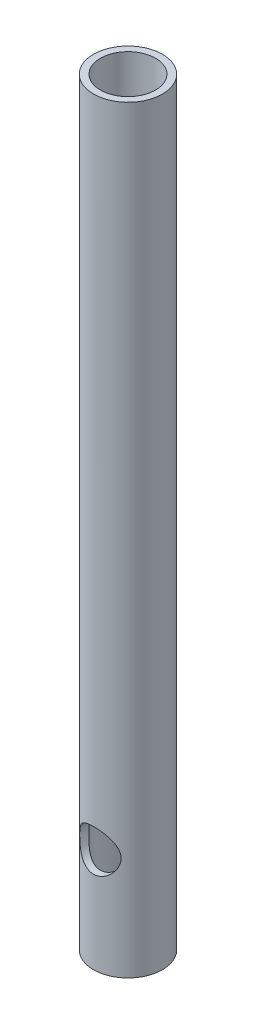
ISO-10303-21;
HEADER;
FILE_DESCRIPTION(('STEP AP214'),'2;1');
FILE_NAME('part.step','',(''),(''),'','','');
FILE_SCHEMA(('AUTOMOTIVE_DESIGN { 1 0 10303 214 1 1 1 1 }'));
ENDSEC;
DATA;
#1=APPLICATION_CONTEXT('core data for automotive mechanical design processes');
#2=APPLICATION_PROTOCOL_DEFINITION('international standard','automotive_design',2000,#1);
#3=PRODUCT_CONTEXT('',#1,'mechanical');
#4=PRODUCT('Part','Part','',(#3));
#5=PRODUCT_RELATED_PRODUCT_CATEGORY('part','',(#4));
#6=PRODUCT_DEFINITION_FORMATION('','',#4);
#7=PRODUCT_DEFINITION_CONTEXT('part definition',#1,'design');
#8=PRODUCT_DEFINITION('design','',#6,#7);
#9=PRODUCT_DEFINITION_SHAPE('','',#8);
#10=(LENGTH_UNIT() NAMED_UNIT(*) SI_UNIT(.MILLI.,.METRE.));
#11=(NAMED_UNIT(*) PLANE_ANGLE_UNIT() SI_UNIT($,.RADIAN.));
#12=(NAMED_UNIT(*) SI_UNIT($,.STERADIAN.) SOLID_ANGLE_UNIT());
#13=UNCERTAINTY_MEASURE_WITH_UNIT(LENGTH_MEASURE(1.E-05),#10,'distance_accuracy_value','');
#14=(GEOMETRIC_REPRESENTATION_CONTEXT(3) GLOBAL_UNCERTAINTY_ASSIGNED_CONTEXT((#13)) GLOBAL_UNIT_ASSIGNED_CONTEXT((#10,
#11,#12)) REPRESENTATION_CONTEXT('',''));
#15=CARTESIAN_POINT('',(0.,0.,0.));
#16=DIRECTION('',(0.,0.,1.));
#17=DIRECTION('',(1.,0.,0.));
#18=AXIS2_PLACEMENT_3D('',#15,#16,#17);
#19=CARTESIAN_POINT('',(87.7298711603,96.4507965263342,127.807872395026));
#20=DIRECTION('',(0.,1.,0.));
#21=DIRECTION('',(0.,0.,1.));
#22=AXIS2_PLACEMENT_3D('',#19,#20,#21);
#23=CYLINDRICAL_SURFACE('',#22,4.99999999999988);
#24=CARTESIAN_POINT('',(87.7298711603,108.450796526334,132.807872395026));
#25=CARTESIAN_POINT('',(87.8066408897352,108.450797582579,132.80787147049));
#26=CARTESIAN_POINT('',(87.8834332948184,108.453750119904,132.806098073149));
#27=CARTESIAN_POINT('',(88.0364196480587,108.465510759314,132.799056020732));
#28=CARTESIAN_POINT('',(88.1126132196466,108.474322287522,132.793785320565));
#29=CARTESIAN_POINT('',(88.3396792903247,108.509445085797,132.772865848551));
#30=CARTESIAN_POINT('',(88.4888530235917,108.544444228768,132.752110120739));
#31=CARTESIAN_POINT('',(88.7774128339359,108.635569269838,132.699104784985));
#32=CARTESIAN_POINT('',(88.9168434277134,108.691590448347,132.666912190537));
#33=CARTESIAN_POINT('',(89.1839215883022,108.822517186931,132.593779417584));
#34=CARTESIAN_POINT('',(89.3115720696826,108.897418058694,132.552841411173));
#35=CARTESIAN_POINT('',(89.5624727641182,109.070346181449,132.46197970786));
#36=CARTESIAN_POINT('',(89.6846400201617,109.169703917501,132.411608265445));
#37=CARTESIAN_POINT('',(89.9116357477806,109.385730933526,132.308481154085));
#38=CARTESIAN_POINT('',(90.016441627804,109.502422400553,132.255722490601));
#39=CARTESIAN_POINT('',(90.2187713553984,109.766643547503,132.146093743359));
#40=CARTESIAN_POINT('',(90.3138265565784,109.916200068456,132.089512751384));
#41=CARTESIAN_POINT('',(90.4770998470079,110.232489672661,131.986638420987));
#42=CARTESIAN_POINT('',(90.5453614918581,110.399194318367,131.940328439775));
#43=CARTESIAN_POINT('',(90.6386832060723,110.703989427991,131.874964988798));
#44=CARTESIAN_POINT('',(90.6701951061764,110.839268524696,131.852030058412));
#45=CARTESIAN_POINT('',(90.7141946061708,111.114403956856,131.819678560302));
#46=CARTESIAN_POINT('',(90.7267058591436,111.254254379638,131.81024518592));
#47=CARTESIAN_POINT('',(90.7319813284982,111.534819518982,131.806290846288));
#48=CARTESIAN_POINT('',(90.7247067966078,111.675535392246,131.811799142593));
#49=CARTESIAN_POINT('',(90.6907924017611,111.953354061452,131.836937616582));
#50=CARTESIAN_POINT('',(90.6641379725544,112.090454059276,131.856578416374));
#51=CARTESIAN_POINT('',(90.5933494796319,112.355857068585,131.906936160855));
#52=CARTESIAN_POINT('',(90.5494456945289,112.484250849329,131.937506728026));
#53=CARTESIAN_POINT('',(90.4457728349707,112.732186292966,132.006413322056));
#54=CARTESIAN_POINT('',(90.3859979444416,112.851724690163,132.044752194441));
#55=CARTESIAN_POINT('',(90.2402288985067,113.100765663991,132.132979378682));
#56=CARTESIAN_POINT('',(90.1514778793187,113.228356518702,132.183715030833));
#57=CARTESIAN_POINT('',(89.9557007923778,113.468145683554,132.286482620267));
#58=CARTESIAN_POINT('',(89.848657253655,113.580329091736,132.338515755802));
#59=CARTESIAN_POINT('',(89.6014615695136,113.802038785783,132.446590064655));
#60=CARTESIAN_POINT('',(89.4587743120877,113.909015917572,132.502179214557));
#61=CARTESIAN_POINT('',(89.2304816966028,114.050065239057,132.578055654976));
#62=CARTESIAN_POINT('',(89.1519693784568,114.09386066185,132.602105547401));
#63=CARTESIAN_POINT('',(88.9906148470391,114.174515349945,132.64703736259));
#64=CARTESIAN_POINT('',(88.9077753353118,114.211378878355,132.667921230916));
#65=CARTESIAN_POINT('',(88.74363487204,114.275607969191,132.704699122475));
#66=CARTESIAN_POINT('',(88.662561226964,114.303423086783,132.720823399575));
#67=CARTESIAN_POINT('',(88.4977511100328,114.35213048218,132.749263662973));
#68=CARTESIAN_POINT('',(88.4140161574747,114.373026634781,132.761581780559));
#69=CARTESIAN_POINT('',(88.2446156229544,114.407568381059,132.782036100175));
#70=CARTESIAN_POINT('',(88.1589515022696,114.421219282163,132.790175363235));
#71=CARTESIAN_POINT('',(87.9864929068922,114.441062710724,132.80203235917));
#72=CARTESIAN_POINT('',(87.8996985929178,114.447256287186,132.805750713923));
#73=CARTESIAN_POINT('',(87.6625469031894,114.453789196618,132.809663974574));
#74=CARTESIAN_POINT('',(87.5118143176894,114.446608071965,132.805337520744));
#75=CARTESIAN_POINT('',(87.214184252671,114.409950984605,132.783451945227));
#76=CARTESIAN_POINT('',(87.067286695447,114.380475473992,132.76589309187));
#77=CARTESIAN_POINT('',(86.7847285610452,114.30170806715,132.719766871583));
#78=CARTESIAN_POINT('',(86.6488816117306,114.252915399742,132.691477539323));
#79=CARTESIAN_POINT('',(86.3873377084525,114.137442202133,132.626150381309));
#80=CARTESIAN_POINT('',(86.2616427628373,114.07075814374,132.58911083018));
#81=CARTESIAN_POINT('',(86.0098592389985,113.913682435356,132.504782205619));
#82=CARTESIAN_POINT('',(85.8850830220578,113.821548832497,132.456828419095));
#83=CARTESIAN_POINT('',(85.6518189348178,113.620013775079,132.357357737285));
#84=CARTESIAN_POINT('',(85.5433503087584,113.510592226732,132.30583673546));
#85=CARTESIAN_POINT('',(85.3312312776584,113.260975734841,132.196780863383));
#86=CARTESIAN_POINT('',(85.2300507814583,113.118628752391,132.139337227327));
#87=CARTESIAN_POINT('',(85.0529663682246,112.816364480207,132.032196038982));
#88=CARTESIAN_POINT('',(84.9770358218454,112.656465939183,131.98249035564));
#89=CARTESIAN_POINT('',(84.8670195867829,112.358310481224,131.907570579319));
#90=CARTESIAN_POINT('',(84.8274386536739,112.222835901692,131.879385581365));
#91=CARTESIAN_POINT('',(84.767597882083,111.945732370099,131.836064510132));
#92=CARTESIAN_POINT('',(84.7473112563493,111.804112236883,131.820910348305));
#93=CARTESIAN_POINT('',(84.7271885499579,111.518042631939,131.805881326925));
#94=CARTESIAN_POINT('',(84.7274293699915,111.373584548086,131.806063922474));
#95=CARTESIAN_POINT('',(84.7485417092689,111.087007651988,131.821826754354));
#96=CARTESIAN_POINT('',(84.7694244466041,110.944890154459,131.837415363263));
#97=CARTESIAN_POINT('',(84.8290676481777,110.673819702339,131.880536094688));
#98=CARTESIAN_POINT('',(84.8669183170135,110.54456237841,131.907456612182));
#99=CARTESIAN_POINT('',(84.9586064251797,110.294121976681,131.969982453192));
#100=CARTESIAN_POINT('',(85.0124498851228,110.172941960721,132.005591046501));
#101=CARTESIAN_POINT('',(85.144085791703,109.922156986874,132.08813212453));
#102=CARTESIAN_POINT('',(85.2242859779844,109.79411501812,132.135963820823));
#103=CARTESIAN_POINT('',(85.4023590228304,109.552035681028,132.234275261766));
#104=CARTESIAN_POINT('',(85.5002464341793,109.438009975855,132.284757162517));
#105=CARTESIAN_POINT('',(85.7296676247744,109.208097683005,132.392384777729));
#106=CARTESIAN_POINT('',(85.8640854423948,109.094946646473,132.449272852412));
#107=CARTESIAN_POINT('',(86.1529783821656,108.892588540286,132.555186690405));
#108=CARTESIAN_POINT('',(86.3074606645632,108.803390053415,132.604209632921));
#109=CARTESIAN_POINT('',(86.5488492636831,108.691672052144,132.667077978175));
#110=CARTESIAN_POINT('',(86.6296210174486,108.65846053037,132.686043786879));
#111=CARTESIAN_POINT('',(86.7944289423116,108.599024388191,132.720306532778));
#112=CARTESIAN_POINT('',(86.8784631755119,108.572795690633,132.735605610391));
#113=CARTESIAN_POINT('',(87.0488693442254,108.527787084259,132.762027674906));
#114=CARTESIAN_POINT('',(87.1352336596907,108.508985449031,132.773162837345));
#115=CARTESIAN_POINT('',(87.3096874142792,108.479052171011,132.790955581478));
#116=CARTESIAN_POINT('',(87.3977753535156,108.467914140181,132.797616892264));
#117=CARTESIAN_POINT('',(87.5267472306386,108.457404842529,132.803909679241));
#118=CARTESIAN_POINT('',(87.5673148791865,108.45492809588,132.805394376818));
#119=CARTESIAN_POINT('',(87.6485432821132,108.45162362942,132.807375996719));
#120=CARTESIAN_POINT('',(87.6892040396728,108.450795966811,132.807872884779));
#121=CARTESIAN_POINT('',(87.7298711603,108.450796526334,132.807872395026));
#122=B_SPLINE_CURVE_WITH_KNOTS('',3,(#24,#25,#26,#27,#28,#29,#30,#31,#32,#33,#34,#35,#36,#37,
#38,#39,#40,#41,#42,#43,#44,#45,#46,#47,#48,#49,#50,#51,#52,#53,#54,#55,#56,#57,#58,#59,#60,#61,
#62,#63,#64,#65,#66,#67,#68,#69,#70,#71,#72,#73,#74,#75,#76,#77,#78,#79,#80,#81,#82,#83,#84,#85,
#86,#87,#88,#89,#90,#91,#92,#93,#94,#95,#96,#97,#98,#99,#100,#101,#102,#103,#104,#105,#106,#107,
#108,#109,#110,#111,#112,#113,#114,#115,#116,#117,#118,#119,#120,#121),.UNSPECIFIED.,.T.,.F.,(4,
2,2,2,2,2,2,2,2,2,2,2,2,2,2,2,2,2,2,2,2,2,2,2,2,2,2,2,2,2,2,2,2,2,2,2,2,2,2,2,2,2,2,2,2,2,2,2,
4),(0.,0.230263300595014,0.460661369333425,0.922002149276126,1.38107466343612,1.84003329022064,
2.33408870888555,2.82878205293211,3.38413315803227,3.93857770807796,4.35913349134877,
4.77916531256767,5.20002031165063,5.62119195971356,6.03692224610025,6.45280509043347,
6.94139679873936,7.43045779030961,7.98767605192996,8.26653157143434,8.54521503013736,
8.80648473589063,9.06760787545944,9.32853946730961,9.5894343502696,10.0398406663534,
10.490237849174,10.9296843257003,11.3692175250854,11.8543559282721,12.3400624135416,
12.8890638604651,13.437484464234,13.8674843581987,14.2968863865713,14.7278971274536,
15.1591422350194,15.5696105785277,15.9802336423656,16.4539008129506,16.927959499309,
17.4794148474153,18.0310675325446,18.2988384573895,18.5664526907295,18.8332781687618,
19.0998809626715,19.2218537856861,19.3438308395354),.UNSPECIFIED.);
#123=CARTESIAN_POINT('',(87.7298711603,108.450796526334,132.807872395026));
#124=VERTEX_POINT('',#123);
#125=EDGE_CURVE('E78',#124,#124,#122,.T.);
#126=ORIENTED_EDGE('',*,*,#125,.F.);
#127=EDGE_LOOP('',(#126));
#128=FACE_BOUND('',#127,.T.);
#129=CARTESIAN_POINT('',(84.7298711603,111.450796526334,123.807872395026));
#130=CARTESIAN_POINT('',(84.7298712543076,111.5262581367,123.80787242408));
#131=CARTESIAN_POINT('',(84.732724559555,111.60171647816,123.805726787242));
#132=CARTESIAN_POINT('',(84.7440751400617,111.75198010549,123.797253336614));
#133=CARTESIAN_POINT('',(84.7525745777817,111.826785130015,123.790923920445));
#134=CARTESIAN_POINT('',(84.78636920153,112.049338927134,123.766012509483));
#135=CARTESIAN_POINT('',(84.8199607923742,112.195262689373,123.741507161388));
#136=CARTESIAN_POINT('',(84.9070022796567,112.476991820207,123.680627731893));
#137=CARTESIAN_POINT('',(84.9603088244876,112.612861936056,123.644339552899));
#138=CARTESIAN_POINT('',(85.084812220907,112.87366369776,123.564153816715));
#139=CARTESIAN_POINT('',(85.1560144089164,112.998592065812,123.52025399097));
#140=CARTESIAN_POINT('',(85.3244477409894,113.25069783658,123.423300280629));
#141=CARTESIAN_POINT('',(85.4237969604605,113.37628260708,123.369783426703));
#142=CARTESIAN_POINT('',(85.641325738708,113.610321882703,123.263349357388));
#143=CARTESIAN_POINT('',(85.7595194093646,113.718763427757,123.210432623469));
#144=CARTESIAN_POINT('',(86.0270253798773,113.927078995049,123.104354413372));
#145=CARTESIAN_POINT('',(86.1783198672009,114.024762939975,123.051783698776));
#146=CARTESIAN_POINT('',(86.4185468559084,114.150543034922,122.982166758332));
#147=CARTESIAN_POINT('',(86.500863792474,114.189020641792,122.960495781416));
#148=CARTESIAN_POINT('',(86.6693989473037,114.258587491213,122.920862367466));
#149=CARTESIAN_POINT('',(86.7556145413532,114.289681618046,122.902897479835));
#150=CARTESIAN_POINT('',(86.9229031336286,114.341423988788,122.872760456161));
#151=CARTESIAN_POINT('',(87.0036870015598,114.362783797863,122.860200230555));
#152=CARTESIAN_POINT('',(87.1672048115556,114.398746487685,122.838949157149));
#153=CARTESIAN_POINT('',(87.2499376397724,114.413353133972,122.830256153101));
#154=CARTESIAN_POINT('',(87.4166265390326,114.43558121085,122.816994846273));
#155=CARTESIAN_POINT('',(87.5005819330346,114.443206368646,122.812424342634));
#156=CARTESIAN_POINT('',(87.6689313714148,114.451363166181,122.807532978952));
#157=CARTESIAN_POINT('',(87.7533253702897,114.451895527628,122.807211686542));
#158=CARTESIAN_POINT('',(87.9850423439463,114.443553744055,122.812219694153));
#159=CARTESIAN_POINT('',(88.1320911175671,114.427325376685,122.821967598885));
#160=CARTESIAN_POINT('',(88.4208274091184,114.373841032652,122.853708489523));
#161=CARTESIAN_POINT('',(88.5625145294313,114.336583499724,122.875702381693));
#162=CARTESIAN_POINT('',(88.8379772309919,114.242464293332,122.930175319906));
#163=CARTESIAN_POINT('',(88.9717021275266,114.185490106134,122.962714473618));
#164=CARTESIAN_POINT('',(89.2278504959035,114.054027591883,123.035679354568));
#165=CARTESIAN_POINT('',(89.3502710211124,113.979534716198,123.076107129577));
#166=CARTESIAN_POINT('',(89.5960190582924,113.805118246716,123.167113966634));
#167=CARTESIAN_POINT('',(89.7177083151075,113.703219877799,123.218328761788));
#168=CARTESIAN_POINT('',(89.9433006495317,113.481988316229,123.322761287058));
#169=CARTESIAN_POINT('',(90.0471792346411,113.362631526615,123.375981654485));
#170=CARTESIAN_POINT('',(90.2463678618932,113.093489705937,123.485650899773));
#171=CARTESIAN_POINT('',(90.3392898095759,112.941781371005,123.541759169189));
#172=CARTESIAN_POINT('',(90.4978155186545,112.621384065308,123.642854802019));
#173=CARTESIAN_POINT('',(90.5634696038137,112.45272709502,123.687862588809));
#174=CARTESIAN_POINT('',(90.6514210983843,112.146009261839,123.749955091273));
#175=CARTESIAN_POINT('',(90.6804292234848,112.010715260542,123.771194622241));
#176=CARTESIAN_POINT('',(90.7194886184705,111.736049306933,123.800029379894));
#177=CARTESIAN_POINT('',(90.7295619354055,111.59668228945,123.807640474579));
#178=CARTESIAN_POINT('',(90.7301667735238,111.317693157373,123.808094106742));
#179=CARTESIAN_POINT('',(90.7206712210619,111.178070956733,123.800916183532));
#180=CARTESIAN_POINT('',(90.6826770050163,110.902821854021,123.772841986273));
#181=CARTESIAN_POINT('',(90.6541633207511,110.767198198514,123.751934868993));
#182=CARTESIAN_POINT('',(90.5796372889793,110.503367310785,123.699237002166));
#183=CARTESIAN_POINT('',(90.5336468041149,110.375151042197,123.667459855444));
#184=CARTESIAN_POINT('',(90.425796842948,110.127841306027,123.596441704437));
#185=CARTESIAN_POINT('',(90.3639313806517,110.00875130174,123.557197886134));
#186=CARTESIAN_POINT('',(90.2132179183386,109.760315431088,123.467135580779));
#187=CARTESIAN_POINT('',(90.121516198827,109.632991094005,123.415505865211));
#188=CARTESIAN_POINT('',(89.9196273012589,109.394229322389,123.311439042497));
#189=CARTESIAN_POINT('',(89.8094224348713,109.28280728024,123.2590012068));
#190=CARTESIAN_POINT('',(89.5563859155832,109.064332535019,123.15115247964));
#191=CARTESIAN_POINT('',(89.4111751305003,108.959731820571,123.096241591595));
#192=CARTESIAN_POINT('',(89.1793174730851,108.822642028611,123.021877813005));
#193=CARTESIAN_POINT('',(89.0996572174165,108.780234524197,122.998415988258));
#194=CARTESIAN_POINT('',(88.9361077219233,108.702492642856,122.954818388161));
#195=CARTESIAN_POINT('',(88.8522211862858,108.667153813216,122.934680520386));
#196=CARTESIAN_POINT('',(88.687011859075,108.6063168831,122.899665722489));
#197=CARTESIAN_POINT('',(88.605940627638,108.580292807872,122.884514082239));
#198=CARTESIAN_POINT('',(88.4413317802813,108.535131544725,122.858047420435));
#199=CARTESIAN_POINT('',(88.3577955750089,108.515990497454,122.84673024908));
#200=CARTESIAN_POINT('',(88.1889907753823,108.484896216621,122.828273355714));
#201=CARTESIAN_POINT('',(88.1037234016041,108.472938088974,122.821130789423));
#202=CARTESIAN_POINT('',(87.9322553194635,108.456389764675,122.81123022527));
#203=CARTESIAN_POINT('',(87.8460547342454,108.451798607545,122.80847165584));
#204=CARTESIAN_POINT('',(87.6103517762194,108.449468236575,122.807078859007));
#205=CARTESIAN_POINT('',(87.4606580253284,108.45919545176,122.81293619745));
#206=CARTESIAN_POINT('',(87.1655456158225,108.500578580483,122.837608480578));
#207=CARTESIAN_POINT('',(87.0201270048445,108.532234738274,122.856423569591));
#208=CARTESIAN_POINT('',(86.7395875428697,108.615237096981,122.904885134796));
#209=CARTESIAN_POINT('',(86.6043391038132,108.666259965883,122.934353388667));
#210=CARTESIAN_POINT('',(86.3443052071185,108.786077468098,123.00180531519));
#211=CARTESIAN_POINT('',(86.2195221040971,108.854876086678,123.039790897147));
#212=CARTESIAN_POINT('',(85.9693446321799,109.01664643323,123.126003778236));
#213=CARTESIAN_POINT('',(85.8453545257591,109.111431589862,123.1748952491));
#214=CARTESIAN_POINT('',(85.6140753824031,109.3183049509,123.275834501438));
#215=CARTESIAN_POINT('',(85.5068051149854,109.430412323999,123.32788574028));
#216=CARTESIAN_POINT('',(85.2980541617736,109.685357569713,123.43730789771));
#217=CARTESIAN_POINT('',(85.1990327485019,109.830289610823,123.494516355124));
#218=CARTESIAN_POINT('',(85.0267250996888,110.137806098929,123.600347817351));
#219=CARTESIAN_POINT('',(84.9534254842233,110.300381310532,123.648975279249));
#220=CARTESIAN_POINT('',(84.8679363111542,110.547419079022,123.707825090389));
#221=CARTESIAN_POINT('',(84.8441587941667,110.626455117631,123.724577308244));
#222=CARTESIAN_POINT('',(84.8030773428445,110.786926968134,123.753921518467));
#223=CARTESIAN_POINT('',(84.7857693125764,110.868361226322,123.766516142479));
#224=CARTESIAN_POINT('',(84.7579589475857,111.032843077028,123.786922672764));
#225=CARTESIAN_POINT('',(84.7474458219848,111.115887894706,123.794742161256));
#226=CARTESIAN_POINT('',(84.7334023154456,111.282888742998,123.805216681248));
#227=CARTESIAN_POINT('',(84.7298710557155,111.366844657597,123.807872362704));
#228=CARTESIAN_POINT('',(84.7298711603,111.450796526334,123.807872395026));
#229=B_SPLINE_CURVE_WITH_KNOTS('',3,(#129,#130,#131,#132,#133,#134,#135,#136,#137,#138,#139,
#140,#141,#142,#143,#144,#145,#146,#147,#148,#149,#150,#151,#152,#153,#154,#155,#156,#157,#158,
#159,#160,#161,#162,#163,#164,#165,#166,#167,#168,#169,#170,#171,#172,#173,#174,#175,#176,#177,
#178,#179,#180,#181,#182,#183,#184,#185,#186,#187,#188,#189,#190,#191,#192,#193,#194,#195,#196,
#197,#198,#199,#200,#201,#202,#203,#204,#205,#206,#207,#208,#209,#210,#211,#212,#213,#214,#215,
#216,#217,#218,#219,#220,#221,#222,#223,#224,#225,#226,#227,#228),.UNSPECIFIED.,.T.,.F.,(4,2,2,
2,2,2,2,2,2,2,2,2,2,2,2,2,2,2,2,2,2,2,2,2,2,2,2,2,2,2,2,2,2,2,2,2,2,2,2,2,2,2,2,2,2,2,2,2,2,4),
(0.,0.226288173517889,0.452663065091124,0.905305714765857,1.35471981612576,1.80426809059901,
2.30878181396805,2.81367513819685,3.37309572088445,3.65297634398313,3.93267130287331,
4.18580566749447,4.43879871451848,4.69165661737854,4.9444887912271,5.38694235003539,
5.82942865693066,6.27448283989929,6.71965270654931,7.21799594026829,7.71701907227943,
8.27387316194679,8.82969494223664,9.24786570023496,9.66554925202083,10.0838110593649,
10.5024036052238,10.9204742264512,11.3387027222345,11.8323285087813,12.3264288987104,
12.8847762993731,13.1641700331408,13.4433872125907,13.7024631857777,13.9613936663243,
14.2201475237758,14.4788676430947,14.9267946196282,15.3747265854331,15.8154875864153,
16.2563474905319,16.7450674536299,17.2343321574793,17.7856420979723,18.3366648323363,
18.5890061072372,18.8411873492279,19.0929671157918,19.3447151893883),.UNSPECIFIED.);
#230=CARTESIAN_POINT('',(84.7298711603,111.450796526334,123.807872395026));
#231=VERTEX_POINT('',#230);
#232=EDGE_CURVE('E73',#231,#231,#229,.T.);
#233=ORIENTED_EDGE('',*,*,#232,.F.);
#234=EDGE_LOOP('',(#233));
#235=FACE_BOUND('',#234,.T.);
#236=CARTESIAN_POINT('',(87.7298711603,96.4507965263342,127.807872395026));
#237=DIRECTION('',(0.,1.,0.));
#238=DIRECTION('',(0.,0.,1.));
#239=AXIS2_PLACEMENT_3D('',#236,#237,#238);
#240=CIRCLE('',#239,4.99999999999988);
#241=CARTESIAN_POINT('',(87.7298711603,96.4507965263342,132.807872395026));
#242=VERTEX_POINT('',#241);
#243=EDGE_CURVE('E10',#242,#242,#240,.T.);
#244=ORIENTED_EDGE('',*,*,#243,.T.);
#245=EDGE_LOOP('',(#244));
#246=FACE_BOUND('',#245,.T.);
#247=CARTESIAN_POINT('',(87.7298711603,206.450796526334,127.807872395026));
#248=DIRECTION('',(0.,1.,0.));
#249=DIRECTION('',(0.,0.,1.));
#250=AXIS2_PLACEMENT_3D('',#247,#248,#249);
#251=CIRCLE('',#250,4.99999999999988);
#252=CARTESIAN_POINT('',(87.7298711603,206.450796526334,132.807872395026));
#253=VERTEX_POINT('',#252);
#254=EDGE_CURVE('E51',#253,#253,#251,.T.);
#255=ORIENTED_EDGE('',*,*,#254,.F.);
#256=EDGE_LOOP('',(#255));
#257=FACE_BOUND('',#256,.T.);
#258=ADVANCED_FACE('F33',(#128,#235,#246,#257),#23,.T.);
#259=CARTESIAN_POINT('',(87.7298711603,96.4507965263342,127.807872395026));
#260=DIRECTION('',(0.,1.,0.));
#261=DIRECTION('',(0.,0.,1.));
#262=AXIS2_PLACEMENT_3D('',#259,#260,#261);
#263=PLANE('',#262);
#264=CARTESIAN_POINT('',(87.7298711603,96.4507965263342,127.807872395026));
#265=DIRECTION('',(0.,1.,0.));
#266=DIRECTION('',(0.,0.,1.));
#267=AXIS2_PLACEMENT_3D('',#264,#265,#266);
#268=CIRCLE('',#267,4.00000000000001);
#269=CARTESIAN_POINT('',(87.7298711603,96.4507965263342,131.807872395026));
#270=VERTEX_POINT('',#269);
#271=EDGE_CURVE('E46',#270,#270,#268,.T.);
#272=ORIENTED_EDGE('',*,*,#271,.T.);
#273=EDGE_LOOP('',(#272));
#274=FACE_BOUND('',#273,.T.);
#275=ORIENTED_EDGE('',*,*,#243,.F.);
#276=EDGE_LOOP('',(#275));
#277=FACE_BOUND('',#276,.T.);
#278=ADVANCED_FACE('F92',(#274,#277),#263,.F.);
#279=CARTESIAN_POINT('',(87.7298711603,96.4507965263342,127.807872395026));
#280=DIRECTION('',(0.,1.,0.));
#281=DIRECTION('',(0.,0.,1.));
#282=AXIS2_PLACEMENT_3D('',#279,#280,#281);
#283=CYLINDRICAL_SURFACE('',#282,4.00000000000001);
#284=CARTESIAN_POINT('',(87.7298711603,108.450796526334,131.807872395026));
#285=CARTESIAN_POINT('',(87.803132528068,108.450797268353,131.807871694038));
#286=CARTESIAN_POINT('',(87.8764135113536,108.453487033321,131.805852998472));
#287=CARTESIAN_POINT('',(88.0223796992935,108.464191386469,131.79783485202));
#288=CARTESIAN_POINT('',(88.0950645210932,108.472209160839,131.79183301919));
#289=CARTESIAN_POINT('',(88.3116025672839,108.504132432362,131.767999845897));
#290=CARTESIAN_POINT('',(88.4537638206924,108.535907484325,131.74434127516));
#291=CARTESIAN_POINT('',(88.7283777993113,108.61822173391,131.683787299105));
#292=CARTESIAN_POINT('',(88.8608837949565,108.668646874717,131.646972398167));
#293=CARTESIAN_POINT('',(89.1147064302409,108.785881893266,131.562882565241));
#294=CARTESIAN_POINT('',(89.2360263288842,108.852686977918,131.515610693561));
#295=CARTESIAN_POINT('',(89.4768032922516,109.007320251555,131.408865965161));
#296=CARTESIAN_POINT('',(89.5950474706052,109.096522377608,131.348668628169));
#297=CARTESIAN_POINT('',(89.8159356597078,109.289797022177,131.223202674838));
#298=CARTESIAN_POINT('',(89.9185550712146,109.393892498782,131.157926301378));
#299=CARTESIAN_POINT('',(90.069803440562,109.571331870439,131.052794767643));
#300=CARTESIAN_POINT('',(90.1236657433415,109.640426638744,131.013161553132));
#301=CARTESIAN_POINT('',(90.2253547457826,109.783385657159,130.934641274364));
#302=CARTESIAN_POINT('',(90.2731796254355,109.857251335385,130.895754438087));
#303=CARTESIAN_POINT('',(90.3624829464933,110.009568321215,130.819978020556));
#304=CARTESIAN_POINT('',(90.4039690072184,110.088013964297,130.783086076458));
#305=CARTESIAN_POINT('',(90.4803024870714,110.249503573883,130.71266579234));
#306=CARTESIAN_POINT('',(90.515150981075,110.332546793048,130.679136908129));
#307=CARTESIAN_POINT('',(90.5874720668895,110.529758801758,130.607417722834));
#308=CARTESIAN_POINT('',(90.6223815303841,110.645566300269,130.571028014264));
#309=CARTESIAN_POINT('',(90.6782877234614,110.883593589468,130.511303683908));
#310=CARTESIAN_POINT('',(90.699316304475,111.005798000671,130.487939193425));
#311=CARTESIAN_POINT('',(90.726126758543,111.255158550806,130.457947749969));
#312=CARTESIAN_POINT('',(90.7317700318729,111.382349299618,130.451472971614));
#313=CARTESIAN_POINT('',(90.7268356507294,111.636027188563,130.457062987476));
#314=CARTESIAN_POINT('',(90.7162521807854,111.762514060129,130.469134428441));
#315=CARTESIAN_POINT('',(90.6818258949266,111.997179030394,130.507224870054));
#316=CARTESIAN_POINT('',(90.6595208739706,112.10586921647,130.531615538886));
#317=CARTESIAN_POINT('',(90.6039845966738,112.317674335783,130.59015624926));
#318=CARTESIAN_POINT('',(90.5707428384774,112.420783798948,130.624315666972));
#319=CARTESIAN_POINT('',(90.4705324363479,112.683309272022,130.722707782326));
#320=CARTESIAN_POINT('',(90.3954741281939,112.837597352218,130.792385378192));
#321=CARTESIAN_POINT('',(90.2222316285809,113.129189581494,130.938538357548));
#322=CARTESIAN_POINT('',(90.1239912459505,113.26645120685,131.015029972638));
#323=CARTESIAN_POINT('',(89.9029032417963,113.526303305085,131.168905841402));
#324=CARTESIAN_POINT('',(89.7794986706998,113.648437739567,131.246264129685));
#325=CARTESIAN_POINT('',(89.5107162038398,113.871323820426,131.392833154591));
#326=CARTESIAN_POINT('',(89.3653812688254,113.972116366863,131.462059360196));
#327=CARTESIAN_POINT('',(89.0856753212578,114.130758124761,131.573466916583));
#328=CARTESIAN_POINT('',(88.9549509009268,114.193165714909,131.618287814194));
#329=CARTESIAN_POINT('',(88.6825755064486,114.299246287119,131.695330483097));
#330=CARTESIAN_POINT('',(88.5409314414553,114.342931002707,131.727560144127));
#331=CARTESIAN_POINT('',(88.2492236262451,114.409303252736,131.776784168738));
#332=CARTESIAN_POINT('',(88.0991137267774,114.431860886592,131.793684258172));
#333=CARTESIAN_POINT('',(87.7962736362298,114.453895718699,131.810190064505));
#334=CARTESIAN_POINT('',(87.6435445778787,114.45338265484,131.809803078091));
#335=CARTESIAN_POINT('',(87.3562627379414,114.43057479578,131.792723350995));
#336=CARTESIAN_POINT('',(87.2214265489724,114.410475480992,131.777674171334));
#337=CARTESIAN_POINT('',(86.9576497753077,114.352848937877,131.734898754749));
#338=CARTESIAN_POINT('',(86.8287104515167,114.315318001174,131.707169820372));
#339=CARTESIAN_POINT('',(86.5750377694751,114.223021574663,131.639869179308));
#340=CARTESIAN_POINT('',(86.4506134544255,114.167694578784,131.599914047843));
#341=CARTESIAN_POINT('',(86.2128334669275,114.042451200121,131.511211456163));
#342=CARTESIAN_POINT('',(86.0994793289064,113.972532799035,131.462462779741));
#343=CARTESIAN_POINT('',(85.8668506953,113.80723184472,131.350258154477));
#344=CARTESIAN_POINT('',(85.7497488458907,113.709546731555,131.285705643586));
#345=CARTESIAN_POINT('',(85.5324204270111,113.4987717207,131.152640078971));
#346=CARTESIAN_POINT('',(85.4322323559172,113.385647711671,131.084118454286));
#347=CARTESIAN_POINT('',(85.2866335506738,113.193966695992,130.975708813674));
#348=CARTESIAN_POINT('',(85.2354590818901,113.119938668129,130.935450947268));
#349=CARTESIAN_POINT('',(85.1396233984844,112.966969804207,130.856557626267));
#350=CARTESIAN_POINT('',(85.0949645768983,112.888027178249,130.817922771455));
#351=CARTESIAN_POINT('',(84.9714612318641,112.644213658146,130.706719751321));
#352=CARTESIAN_POINT('',(84.9026424947538,112.471774650174,130.638501739963));
#353=CARTESIAN_POINT('',(84.8175495419709,112.179950292089,130.550245457198));
#354=CARTESIAN_POINT('',(84.7912490933393,112.066009685843,130.521787420378));
#355=CARTESIAN_POINT('',(84.7520425891551,111.833387009769,130.478714725511));
#356=CARTESIAN_POINT('',(84.7391066357516,111.714716142961,130.464069173839));
#357=CARTESIAN_POINT('',(84.7275641737541,111.475137331273,130.451024074671));
#358=CARTESIAN_POINT('',(84.7290304099169,111.35422111188,130.452707000998));
#359=CARTESIAN_POINT('',(84.7463339279864,111.114682376656,130.472201573895));
#360=CARTESIAN_POINT('',(84.7621897548897,110.996063022514,130.490034033576));
#361=CARTESIAN_POINT('',(84.8119928679285,110.738970950749,130.544218791797));
#362=CARTESIAN_POINT('',(84.8491340012931,110.601817291694,130.583764253143));
#363=CARTESIAN_POINT('',(84.9404844296348,110.337711664627,130.675533929373));
#364=CARTESIAN_POINT('',(84.9947368391297,110.210786494422,130.727790093903));
#365=CARTESIAN_POINT('',(85.0982579357536,110.007524046499,130.820806796772));
#366=CARTESIAN_POINT('',(85.1433879921761,109.928181670039,130.859763119575));
#367=CARTESIAN_POINT('',(85.2402485824758,109.774481802802,130.939277754217));
#368=CARTESIAN_POINT('',(85.291978764081,109.700124046301,130.979835980478));
#369=CARTESIAN_POINT('',(85.4018668605683,109.556441065624,131.061344879821));
#370=CARTESIAN_POINT('',(85.4600302074855,109.487120177573,131.102295857477));
#371=CARTESIAN_POINT('',(85.5826153581249,109.353776351468,131.183475638538));
#372=CARTESIAN_POINT('',(85.6470374702554,109.289753674777,131.223704406238));
#373=CARTESIAN_POINT('',(85.7825892574851,109.166823193257,131.302768908863));
#374=CARTESIAN_POINT('',(85.8537712511959,109.107963444974,131.341589911716));
#375=CARTESIAN_POINT('',(86.0021912894205,108.996466769272,131.416477420589));
#376=CARTESIAN_POINT('',(86.0794280559644,108.943828534539,131.452544504719));
#377=CARTESIAN_POINT('',(86.2395679861951,108.845454584279,131.520897809484));
#378=CARTESIAN_POINT('',(86.3224609789047,108.799706929902,131.553190547406));
#379=CARTESIAN_POINT('',(86.4935287248171,108.715739810291,131.613088799704));
#380=CARTESIAN_POINT('',(86.581700721331,108.677516459828,131.640696732093));
#381=CARTESIAN_POINT('',(86.8001320200425,108.595233827367,131.700575336795));
#382=CARTESIAN_POINT('',(86.932748129098,108.555272163517,131.73007102368));
#383=CARTESIAN_POINT('',(87.2042036967694,108.493951646745,131.775554993795));
#384=CARTESIAN_POINT('',(87.3430246221698,108.472540839546,131.791580996967));
#385=CARTESIAN_POINT('',(87.5239431597169,108.457587227711,131.802781777043));
#386=CARTESIAN_POINT('',(87.5650550514799,108.455043423513,131.804688159396));
#387=CARTESIAN_POINT('',(87.6473995982407,108.451647727803,131.807233767674));
#388=CARTESIAN_POINT('',(87.6886322716094,108.450796108651,131.807872789613));
#389=CARTESIAN_POINT('',(87.7298711603,108.450796526334,131.807872395026));
#390=B_SPLINE_CURVE_WITH_KNOTS('',3,(#284,#285,#286,#287,#288,#289,#290,#291,#292,#293,#294,
#295,#296,#297,#298,#299,#300,#301,#302,#303,#304,#305,#306,#307,#308,#309,#310,#311,#312,#313,
#314,#315,#316,#317,#318,#319,#320,#321,#322,#323,#324,#325,#326,#327,#328,#329,#330,#331,#332,
#333,#334,#335,#336,#337,#338,#339,#340,#341,#342,#343,#344,#345,#346,#347,#348,#349,#350,#351,
#352,#353,#354,#355,#356,#357,#358,#359,#360,#361,#362,#363,#364,#365,#366,#367,#368,#369,#370,
#371,#372,#373,#374,#375,#376,#377,#378,#379,#380,#381,#382,#383,#384,#385,#386,#387,#388,#389),
.UNSPECIFIED.,.T.,.F.,(4,2,2,2,2,2,2,2,2,2,2,2,2,2,2,2,2,2,2,2,2,2,2,2,2,2,2,2,2,2,2,2,2,2,2,2,
2,2,2,2,2,2,2,2,2,2,2,2,2,2,2,2,4),(0.,0.219733524191398,0.439598569068989,0.879847634771401,
1.31744766307169,1.75491979362351,2.23290362227349,2.71163236402816,2.99983518527193,
3.28812468015061,3.57606487508906,3.86395840178999,4.24151729125789,4.61820678456565,
4.99827867308499,5.37848680666403,5.71806472391402,6.05796967267267,6.61051355677807,
7.16441076781766,7.73224459942168,8.29898017053371,8.75205702078767,9.20484951352222,
9.66040808399783,10.1157743699921,10.5253506608997,10.9350141243761,11.3591357103334,
11.7833160002107,12.2783345622972,12.7744651003689,13.0698938265097,13.3654307846348,
13.9540907813182,14.3138420927747,14.6727868466003,15.0335455414111,15.3947698355935,
15.8348522835192,16.276052567115,16.5734564783343,16.8708445226936,17.1684856206865,
17.4661413927621,17.7663250552985,18.0664455283282,18.3660398682405,18.6654791022959,
19.0884486476652,19.5102297424977,19.6338980344064,19.7575862294511),.UNSPECIFIED.);
#391=CARTESIAN_POINT('',(87.7298711603,108.450796526334,131.807872395026));
#392=VERTEX_POINT('',#391);
#393=EDGE_CURVE('E37',#392,#392,#390,.T.);
#394=ORIENTED_EDGE('',*,*,#393,.T.);
#395=EDGE_LOOP('',(#394));
#396=FACE_BOUND('',#395,.T.);
#397=CARTESIAN_POINT('',(84.7298711603,111.450796526334,125.162121083961));
#398=CARTESIAN_POINT('',(84.7298683513344,111.520836537289,125.162126884809));
#399=CARTESIAN_POINT('',(84.7323302106734,111.590854157897,125.159324838173));
#400=CARTESIAN_POINT('',(84.7420878079584,111.730134893374,125.148323021763));
#401=CARTESIAN_POINT('',(84.7493851586781,111.79939774867,125.1401214511));
#402=CARTESIAN_POINT('',(84.77831214175,112.005309147595,125.108027935595));
#403=CARTESIAN_POINT('',(84.8069758691363,112.139870471814,125.076649356873));
#404=CARTESIAN_POINT('',(84.880192131774,112.397994627057,125.000378253715));
#405=CARTESIAN_POINT('',(84.9245199948354,112.521683588681,124.955678152569));
#406=CARTESIAN_POINT('',(85.0272595506974,112.759477927551,124.85814057229));
#407=CARTESIAN_POINT('',(85.0856695412976,112.873584460842,124.805304076936));
#408=CARTESIAN_POINT('',(85.2290684443414,113.115021671993,124.684329126511));
#409=CARTESIAN_POINT('',(85.3170618979119,113.240116512217,124.615303548653));
#410=CARTESIAN_POINT('',(85.5112170348725,113.475863364948,124.477439865579));
#411=CARTESIAN_POINT('',(85.617405473357,113.586493679376,124.408602190305));
#412=CARTESIAN_POINT('',(85.8015062583981,113.75079963562,124.302474699406));
#413=CARTESIAN_POINT('',(85.8739008695497,113.809646040494,124.263512745025));
#414=CARTESIAN_POINT('',(86.0248293459924,113.920942020534,124.188490509031));
#415=CARTESIAN_POINT('',(86.1033603503644,113.973394547807,124.152428890945));
#416=CARTESIAN_POINT('',(86.2661670692173,114.071210453622,124.084252821932));
#417=CARTESIAN_POINT('',(86.3504335921145,114.116584808354,124.052132276396));
#418=CARTESIAN_POINT('',(86.5242762122247,114.199581808787,123.992773268023));
#419=CARTESIAN_POINT('',(86.6138494681833,114.237208555156,123.965532223552));
#420=CARTESIAN_POINT('',(86.8340716809262,114.317175636076,123.907218321043));
#421=CARTESIAN_POINT('',(86.9669626057394,114.355501005041,123.878886508692));
#422=CARTESIAN_POINT('',(87.2387823825203,114.413586463124,123.835751351441));
#423=CARTESIAN_POINT('',(87.377705878587,114.43336268187,123.820936253233));
#424=CARTESIAN_POINT('',(87.6581365533486,114.45323738399,123.806047122398));
#425=CARTESIAN_POINT('',(87.7996494949711,114.453284736445,123.806011393175));
#426=CARTESIAN_POINT('',(88.0805046574883,114.433561351577,123.820787665527));
#427=CARTESIAN_POINT('',(88.2198463680982,114.413786024778,123.83560310554));
#428=CARTESIAN_POINT('',(88.4876492464227,114.356634247206,123.878044988784));
#429=CARTESIAN_POINT('',(88.6163196157088,114.319883825709,123.905215280759));
#430=CARTESIAN_POINT('',(88.8652322114742,114.230805289831,123.97022678083));
#431=CARTESIAN_POINT('',(88.9854725931342,114.178473778747,124.008070315614));
#432=CARTESIAN_POINT('',(89.2283049787974,114.05373728115,124.096651488113));
#433=CARTESIAN_POINT('',(89.3497419229255,113.979772329082,124.14834158631));
#434=CARTESIAN_POINT('',(89.5790056682041,113.817329122411,124.258658341902));
#435=CARTESIAN_POINT('',(89.686820731509,113.728838500093,124.317290898413));
#436=CARTESIAN_POINT('',(89.9080352436131,113.520349827306,124.44999707878));
#437=CARTESIAN_POINT('',(90.0183610198053,113.397578105946,124.524839278036));
#438=CARTESIAN_POINT('',(90.2178886720152,113.135127359426,124.673353229013));
#439=CARTESIAN_POINT('',(90.3070804845372,112.995440327241,124.747024407607));
#440=CARTESIAN_POINT('',(90.4473352885259,112.728832785878,124.871483875162));
#441=CARTESIAN_POINT('',(90.5024484980208,112.604822436074,124.923920399439));
#442=CARTESIAN_POINT('',(90.5962591021178,112.346665963155,125.017137569666));
#443=CARTESIAN_POINT('',(90.6349935950291,112.212543565628,125.057944487887));
#444=CARTESIAN_POINT('',(90.6879188684648,111.9634226394,125.115071383205));
#445=CARTESIAN_POINT('',(90.7054525541509,111.849902365711,125.134641605857));
#446=CARTESIAN_POINT('',(90.7273063687815,111.620085590381,125.159160624293));
#447=CARTESIAN_POINT('',(90.7316434032667,111.503792833173,125.164128126584));
#448=CARTESIAN_POINT('',(90.726776577115,111.271838556227,125.158615026495));
#449=CARTESIAN_POINT('',(90.7175677323991,111.156177284556,125.148128738036));
#450=CARTESIAN_POINT('',(90.6863216515376,110.928644171522,125.113447992326));
#451=CARTESIAN_POINT('',(90.6642625189892,110.816779143968,125.089230138892));
#452=CARTESIAN_POINT('',(90.5981506297585,110.558120692722,125.01931736888));
#453=CARTESIAN_POINT('',(90.548956174424,110.41392574111,124.968976532662));
#454=CARTESIAN_POINT('',(90.4316474960747,110.138180074372,124.857114560713));
#455=CARTESIAN_POINT('',(90.3634984377567,110.006653246068,124.795572912488));
#456=CARTESIAN_POINT('',(90.2072714156304,109.752102906742,124.665709142675));
#457=CARTESIAN_POINT('',(90.1185714833278,109.629547466275,124.59722381191));
#458=CARTESIAN_POINT('',(89.9235042879451,109.398775633105,124.460913171345));
#459=CARTESIAN_POINT('',(89.8171284415894,109.290566252851,124.393088199231));
#460=CARTESIAN_POINT('',(89.6322693472181,109.129264394677,124.288301617449));
#461=CARTESIAN_POINT('',(89.5590942115599,109.071138406808,124.249622059749));
#462=CARTESIAN_POINT('',(89.4066289385237,108.961358382012,124.175288395485));
#463=CARTESIAN_POINT('',(89.3273416985895,108.909701308606,124.139632872009));
#464=CARTESIAN_POINT('',(89.1630491157337,108.813555163685,124.072385171802));
#465=CARTESIAN_POINT('',(89.0780516999382,108.769056434666,124.04078753229));
#466=CARTESIAN_POINT('',(88.9028164885208,108.687913182582,123.982597654075));
#467=CARTESIAN_POINT('',(88.8125815547273,108.651264420626,123.95600271492));
#468=CARTESIAN_POINT('',(88.5914447486652,108.57395706222,123.899515658873));
#469=CARTESIAN_POINT('',(88.4583879532003,108.537292721609,123.872371242989));
#470=CARTESIAN_POINT('',(88.1865834269212,108.482529160655,123.831658682219));
#471=CARTESIAN_POINT('',(88.0478408999283,108.464413341879,123.818078399524));
#472=CARTESIAN_POINT('',(87.7681708521456,108.447766371976,123.805603319326));
#473=CARTESIAN_POINT('',(87.6272389745101,108.44928119504,123.806742995365));
#474=CARTESIAN_POINT('',(87.3478519385359,108.471917805347,123.823695725271));
#475=CARTESIAN_POINT('',(87.2093974500148,108.493044815915,123.839512688147));
#476=CARTESIAN_POINT('',(86.942827597687,108.552746539108,123.883804531869));
#477=CARTESIAN_POINT('',(86.8145287699288,108.590796936926,123.911898621269));
#478=CARTESIAN_POINT('',(86.5665483914357,108.682372609613,123.978617941414));
#479=CARTESIAN_POINT('',(86.4468686908379,108.735901194656,124.017245424737));
#480=CARTESIAN_POINT('',(86.2047757880204,108.863352414151,124.107519565332));
#481=CARTESIAN_POINT('',(86.0835886911511,108.938898382973,124.160145350047));
#482=CARTESIAN_POINT('',(85.8550415325695,109.104529413528,124.27216226433));
#483=CARTESIAN_POINT('',(85.747694343698,109.194627837909,124.331559596915));
#484=CARTESIAN_POINT('',(85.5276235373064,109.406807215133,124.465745360773));
#485=CARTESIAN_POINT('',(85.418037280327,109.53168913912,124.541254048634));
#486=CARTESIAN_POINT('',(85.220366140864,109.798532856296,124.69055064202));
#487=CARTESIAN_POINT('',(85.1322891360184,109.940500878837,124.764337908163));
#488=CARTESIAN_POINT('',(84.9959515877643,110.208562478326,124.886880670595));
#489=CARTESIAN_POINT('',(84.9432001409994,110.331464646609,124.937600917792));
#490=CARTESIAN_POINT('',(84.853763690949,110.586964192642,125.027220081823));
#491=CARTESIAN_POINT('',(84.8170360232626,110.719534714197,125.066150304711));
#492=CARTESIAN_POINT('',(84.7699287209199,110.952368154802,125.117226594316));
#493=CARTESIAN_POINT('',(84.7549820409126,111.05071516503,125.133878384666));
#494=CARTESIAN_POINT('',(84.7349585150599,111.24965668572,125.156317901356));
#495=CARTESIAN_POINT('',(84.7298751927471,111.3502496775,125.162112756479));
#496=CARTESIAN_POINT('',(84.7298711603,111.450796526334,125.162121083961));
#497=B_SPLINE_CURVE_WITH_KNOTS('',3,(#397,#398,#399,#400,#401,#402,#403,#404,#405,#406,#407,
#408,#409,#410,#411,#412,#413,#414,#415,#416,#417,#418,#419,#420,#421,#422,#423,#424,#425,#426,
#427,#428,#429,#430,#431,#432,#433,#434,#435,#436,#437,#438,#439,#440,#441,#442,#443,#444,#445,
#446,#447,#448,#449,#450,#451,#452,#453,#454,#455,#456,#457,#458,#459,#460,#461,#462,#463,#464,
#465,#466,#467,#468,#469,#470,#471,#472,#473,#474,#475,#476,#477,#478,#479,#480,#481,#482,#483,
#484,#485,#486,#487,#488,#489,#490,#491,#492,#493,#494,#495,#496),.UNSPECIFIED.,.T.,.F.,(4,2,2,
2,2,2,2,2,2,2,2,2,2,2,2,2,2,2,2,2,2,2,2,2,2,2,2,2,2,2,2,2,2,2,2,2,2,2,2,2,2,2,2,2,2,2,2,2,2,4),
(0.,0.209978661686255,0.420027392494299,0.840743284291311,1.25565461036558,1.67051580847001,
2.17226801294869,2.67476445976232,2.97770625271009,3.28050764081974,3.5828347013567,
3.88500133203437,4.30659768868619,4.72782710054932,5.15014819769123,5.57256709596086,
5.98051830103609,6.3885585053085,6.84078006547299,7.29338868088835,7.83503352722913,
8.37693577609376,8.81203137267905,9.24613611539525,9.59420329405315,9.94182439389899,
10.2895734296594,10.6379167570555,11.1166437471831,11.5962564359182,12.0929073649364,
12.5898001720676,12.8928465253495,13.1957500925974,13.4982415141316,13.8005691796994,
14.2206053318567,14.6402652787518,15.060908229989,15.481663243447,15.8902036618064,
16.2988315155548,16.7537484577604,17.2090855228611,17.7544990195313,18.3001119721388,
18.7279130007849,19.1545679234221,19.4562036495329,19.7576412488017),.UNSPECIFIED.);
#498=CARTESIAN_POINT('',(84.7298711603,111.450796526334,125.162121083961));
#499=VERTEX_POINT('',#498);
#500=EDGE_CURVE('E54',#499,#499,#497,.T.);
#501=ORIENTED_EDGE('',*,*,#500,.T.);
#502=EDGE_LOOP('',(#501));
#503=FACE_BOUND('',#502,.T.);
#504=ORIENTED_EDGE('',*,*,#271,.F.);
#505=EDGE_LOOP('',(#504));
#506=FACE_BOUND('',#505,.T.);
#507=CARTESIAN_POINT('',(87.7298711603,206.450796526334,127.807872395026));
#508=DIRECTION('',(0.,1.,0.));
#509=DIRECTION('',(0.,0.,1.));
#510=AXIS2_PLACEMENT_3D('',#507,#508,#509);
#511=CIRCLE('',#510,4.00000000000001);
#512=CARTESIAN_POINT('',(87.7298711603,206.450796526334,131.807872395026));
#513=VERTEX_POINT('',#512);
#514=EDGE_CURVE('E84',#513,#513,#511,.T.);
#515=ORIENTED_EDGE('',*,*,#514,.T.);
#516=EDGE_LOOP('',(#515));
#517=FACE_BOUND('',#516,.T.);
#518=ADVANCED_FACE('F59',(#396,#503,#506,#517),#283,.F.);
#519=CARTESIAN_POINT('',(87.7298711603,206.450796526334,127.807872395026));
#520=DIRECTION('',(0.,1.,0.));
#521=DIRECTION('',(0.,0.,1.));
#522=AXIS2_PLACEMENT_3D('',#519,#520,#521);
#523=PLANE('',#522);
#524=ORIENTED_EDGE('',*,*,#254,.T.);
#525=EDGE_LOOP('',(#524));
#526=FACE_BOUND('',#525,.T.);
#527=ORIENTED_EDGE('',*,*,#514,.F.);
#528=EDGE_LOOP('',(#527));
#529=FACE_BOUND('',#528,.T.);
#530=ADVANCED_FACE('F67',(#526,#529),#523,.T.);
#531=CARTESIAN_POINT('',(87.7298711603,111.450796526334,132.807872395026));
#532=DIRECTION('',(0.,0.,-1.));
#533=DIRECTION('',(-1.,0.,0.));
#534=AXIS2_PLACEMENT_3D('',#531,#532,#533);
#535=CYLINDRICAL_SURFACE('',#534,3.00000000000001);
#536=ORIENTED_EDGE('',*,*,#232,.T.);
#537=EDGE_LOOP('',(#536));
#538=FACE_BOUND('',#537,.T.);
#539=ORIENTED_EDGE('',*,*,#500,.F.);
#540=EDGE_LOOP('',(#539));
#541=FACE_BOUND('',#540,.T.);
#542=ADVANCED_FACE('F65',(#538,#541),#535,.F.);
#543=ORIENTED_EDGE('',*,*,#125,.T.);
#544=EDGE_LOOP('',(#543));
#545=FACE_BOUND('',#544,.T.);
#546=ORIENTED_EDGE('',*,*,#393,.F.);
#547=EDGE_LOOP('',(#546));
#548=FACE_BOUND('',#547,.T.);
#549=ADVANCED_FACE('F62',(#545,#548),#535,.F.);
#550=CLOSED_SHELL('',(#258,#278,#518,#530,#542,#549));
#551=MANIFOLD_SOLID_BREP('B2',#550);
#552=ADVANCED_BREP_SHAPE_REPRESENTATION('',(#18,#551),#14);
#553=SHAPE_DEFINITION_REPRESENTATION(#9,#552);
ENDSEC;
END-ISO-10303-21;
